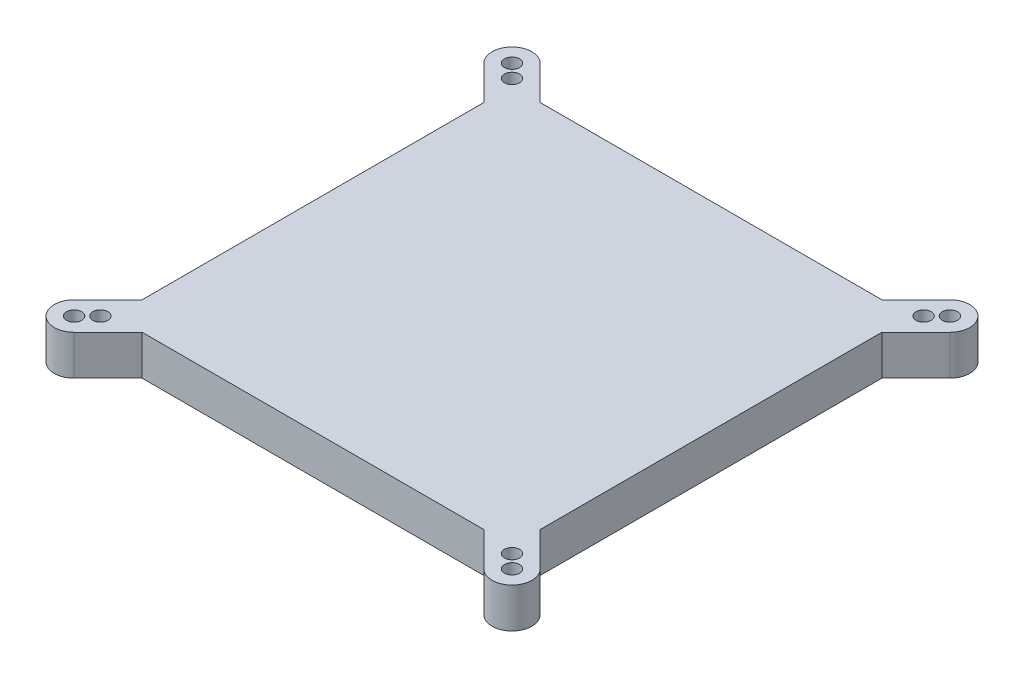
ISO-10303-21;
HEADER;
FILE_DESCRIPTION(('STEP AP214'),'2;1');
FILE_NAME('part.step','',(''),(''),'','','');
FILE_SCHEMA(('AUTOMOTIVE_DESIGN { 1 0 10303 214 1 1 1 1 }'));
ENDSEC;
DATA;
#1=APPLICATION_CONTEXT('core data for automotive mechanical design processes');
#2=APPLICATION_PROTOCOL_DEFINITION('international standard','automotive_design',2000,#1);
#3=PRODUCT_CONTEXT('',#1,'mechanical');
#4=PRODUCT('Part','Part','',(#3));
#5=PRODUCT_RELATED_PRODUCT_CATEGORY('part','',(#4));
#6=PRODUCT_DEFINITION_FORMATION('','',#4);
#7=PRODUCT_DEFINITION_CONTEXT('part definition',#1,'design');
#8=PRODUCT_DEFINITION('design','',#6,#7);
#9=PRODUCT_DEFINITION_SHAPE('','',#8);
#10=(LENGTH_UNIT() NAMED_UNIT(*) SI_UNIT(.MILLI.,.METRE.));
#11=(NAMED_UNIT(*) PLANE_ANGLE_UNIT() SI_UNIT($,.RADIAN.));
#12=(NAMED_UNIT(*) SI_UNIT($,.STERADIAN.) SOLID_ANGLE_UNIT());
#13=UNCERTAINTY_MEASURE_WITH_UNIT(LENGTH_MEASURE(1.E-05),#10,'distance_accuracy_value','');
#14=(GEOMETRIC_REPRESENTATION_CONTEXT(3) GLOBAL_UNCERTAINTY_ASSIGNED_CONTEXT((#13)) GLOBAL_UNIT_ASSIGNED_CONTEXT((#10,
#11,#12)) REPRESENTATION_CONTEXT('',''));
#15=CARTESIAN_POINT('',(0.,0.,0.));
#16=DIRECTION('',(0.,0.,1.));
#17=DIRECTION('',(1.,0.,0.));
#18=AXIS2_PLACEMENT_3D('',#15,#16,#17);
#19=CARTESIAN_POINT('',(200.,20.,0.));
#20=DIRECTION('',(-1.,0.,0.));
#21=DIRECTION('',(0.,0.,1.));
#22=AXIS2_PLACEMENT_3D('',#19,#20,#21);
#23=PLANE('',#22);
#24=DIRECTION('',(0.,-1.,0.));
#25=VECTOR('',#24,1.);
#26=CARTESIAN_POINT('',(200.,68.3076870304613,-185.857864376269));
#27=LINE('',#26,#25);
#28=CARTESIAN_POINT('',(200.,20.,-185.857864376269));
#29=VERTEX_POINT('',#28);
#30=CARTESIAN_POINT('',(200.,0.,-185.857864376269));
#31=VERTEX_POINT('',#30);
#32=EDGE_CURVE('E224',#29,#31,#27,.T.);
#33=ORIENTED_EDGE('',*,*,#32,.F.);
#34=DIRECTION('',(0.,0.,-1.));
#35=VECTOR('',#34,1.);
#36=CARTESIAN_POINT('',(200.,20.,0.));
#37=LINE('',#36,#35);
#38=CARTESIAN_POINT('',(200.,20.,-14.142135623731));
#39=VERTEX_POINT('',#38);
#40=EDGE_CURVE('E46',#39,#29,#37,.T.);
#41=ORIENTED_EDGE('',*,*,#40,.F.);
#42=DIRECTION('',(0.,-1.,0.));
#43=VECTOR('',#42,1.);
#44=CARTESIAN_POINT('',(200.,68.3076870304613,-14.142135623731));
#45=LINE('',#44,#43);
#46=CARTESIAN_POINT('',(200.,0.,-14.142135623731));
#47=VERTEX_POINT('',#46);
#48=EDGE_CURVE('E253',#39,#47,#45,.T.);
#49=ORIENTED_EDGE('',*,*,#48,.T.);
#50=DIRECTION('',(0.,0.,-1.));
#51=VECTOR('',#50,1.);
#52=CARTESIAN_POINT('',(200.,0.,0.));
#53=LINE('',#52,#51);
#54=EDGE_CURVE('E315',#47,#31,#53,.T.);
#55=ORIENTED_EDGE('',*,*,#54,.T.);
#56=EDGE_LOOP('',(#33,#41,#49,#55));
#57=FACE_BOUND('',#56,.T.);
#58=ADVANCED_FACE('F37',(#57),#23,.F.);
#59=CARTESIAN_POINT('',(0.,20.,-200.));
#60=DIRECTION('',(0.,0.,1.));
#61=DIRECTION('',(1.,0.,0.));
#62=AXIS2_PLACEMENT_3D('',#59,#60,#61);
#63=PLANE('',#62);
#64=DIRECTION('',(-1.,0.,0.));
#65=VECTOR('',#64,1.);
#66=CARTESIAN_POINT('',(0.,0.,-200.));
#67=LINE('',#66,#65);
#68=CARTESIAN_POINT('',(185.857864376269,0.,-200.));
#69=VERTEX_POINT('',#68);
#70=CARTESIAN_POINT('',(14.1421356237309,0.,-200.));
#71=VERTEX_POINT('',#70);
#72=EDGE_CURVE('E41',#69,#71,#67,.T.);
#73=ORIENTED_EDGE('',*,*,#72,.T.);
#74=DIRECTION('',(0.,-1.,0.));
#75=VECTOR('',#74,1.);
#76=CARTESIAN_POINT('',(14.142135623731,68.3076870304613,-200.));
#77=LINE('',#76,#75);
#78=CARTESIAN_POINT('',(14.1421356237309,20.,-200.));
#79=VERTEX_POINT('',#78);
#80=EDGE_CURVE('E62',#79,#71,#77,.T.);
#81=ORIENTED_EDGE('',*,*,#80,.F.);
#82=DIRECTION('',(-1.,0.,0.));
#83=VECTOR('',#82,1.);
#84=CARTESIAN_POINT('',(0.,20.,-200.));
#85=LINE('',#84,#83);
#86=CARTESIAN_POINT('',(185.857864376269,20.,-200.));
#87=VERTEX_POINT('',#86);
#88=EDGE_CURVE('E11',#87,#79,#85,.T.);
#89=ORIENTED_EDGE('',*,*,#88,.F.);
#90=DIRECTION('',(0.,-1.,0.));
#91=VECTOR('',#90,1.);
#92=CARTESIAN_POINT('',(185.857864376269,68.3076870304613,-200.));
#93=LINE('',#92,#91);
#94=EDGE_CURVE('E221',#87,#69,#93,.T.);
#95=ORIENTED_EDGE('',*,*,#94,.T.);
#96=EDGE_LOOP('',(#73,#81,#89,#95));
#97=FACE_BOUND('',#96,.T.);
#98=ADVANCED_FACE('F318',(#97),#63,.F.);
#99=CARTESIAN_POINT('',(0.,20.,0.));
#100=DIRECTION('',(1.,0.,0.));
#101=DIRECTION('',(0.,0.,-1.));
#102=AXIS2_PLACEMENT_3D('',#99,#100,#101);
#103=PLANE('',#102);
#104=DIRECTION('',(0.,0.,1.));
#105=VECTOR('',#104,1.);
#106=CARTESIAN_POINT('',(0.,20.,0.));
#107=LINE('',#106,#105);
#108=CARTESIAN_POINT('',(0.,20.,-185.857864376269));
#109=VERTEX_POINT('',#108);
#110=CARTESIAN_POINT('',(0.,20.,-14.142135623731));
#111=VERTEX_POINT('',#110);
#112=EDGE_CURVE('E54',#109,#111,#107,.T.);
#113=ORIENTED_EDGE('',*,*,#112,.F.);
#114=DIRECTION('',(0.,-1.,0.));
#115=VECTOR('',#114,1.);
#116=CARTESIAN_POINT('',(0.,68.3076870304613,-185.857864376269));
#117=LINE('',#116,#115);
#118=CARTESIAN_POINT('',(0.,0.,-185.857864376269));
#119=VERTEX_POINT('',#118);
#120=EDGE_CURVE('E168',#109,#119,#117,.T.);
#121=ORIENTED_EDGE('',*,*,#120,.T.);
#122=DIRECTION('',(0.,0.,1.));
#123=VECTOR('',#122,1.);
#124=CARTESIAN_POINT('',(0.,0.,0.));
#125=LINE('',#124,#123);
#126=CARTESIAN_POINT('',(0.,0.,-14.142135623731));
#127=VERTEX_POINT('',#126);
#128=EDGE_CURVE('E280',#119,#127,#125,.T.);
#129=ORIENTED_EDGE('',*,*,#128,.T.);
#130=DIRECTION('',(0.,-1.,0.));
#131=VECTOR('',#130,1.);
#132=CARTESIAN_POINT('',(0.,68.3076870304613,-14.142135623731));
#133=LINE('',#132,#131);
#134=EDGE_CURVE('E301',#111,#127,#133,.T.);
#135=ORIENTED_EDGE('',*,*,#134,.F.);
#136=EDGE_LOOP('',(#113,#121,#129,#135));
#137=FACE_BOUND('',#136,.T.);
#138=ADVANCED_FACE('F39',(#137),#103,.F.);
#139=CARTESIAN_POINT('',(0.,20.,0.));
#140=DIRECTION('',(0.,0.,-1.));
#141=DIRECTION('',(-1.,0.,0.));
#142=AXIS2_PLACEMENT_3D('',#139,#140,#141);
#143=PLANE('',#142);
#144=DIRECTION('',(1.,0.,0.));
#145=VECTOR('',#144,1.);
#146=CARTESIAN_POINT('',(0.,0.,0.));
#147=LINE('',#146,#145);
#148=CARTESIAN_POINT('',(14.142135623731,0.,0.));
#149=VERTEX_POINT('',#148);
#150=CARTESIAN_POINT('',(185.857864376269,0.,0.));
#151=VERTEX_POINT('',#150);
#152=EDGE_CURVE('E314',#149,#151,#147,.T.);
#153=ORIENTED_EDGE('',*,*,#152,.T.);
#154=DIRECTION('',(0.,-1.,0.));
#155=VECTOR('',#154,1.);
#156=CARTESIAN_POINT('',(185.857864376269,68.3076870304613,0.));
#157=LINE('',#156,#155);
#158=CARTESIAN_POINT('',(185.857864376269,20.,0.));
#159=VERTEX_POINT('',#158);
#160=EDGE_CURVE('E246',#159,#151,#157,.T.);
#161=ORIENTED_EDGE('',*,*,#160,.F.);
#162=DIRECTION('',(1.,0.,0.));
#163=VECTOR('',#162,1.);
#164=CARTESIAN_POINT('',(0.,20.,0.));
#165=LINE('',#164,#163);
#166=CARTESIAN_POINT('',(14.142135623731,20.,0.));
#167=VERTEX_POINT('',#166);
#168=EDGE_CURVE('E308',#167,#159,#165,.T.);
#169=ORIENTED_EDGE('',*,*,#168,.F.);
#170=DIRECTION('',(0.,-1.,0.));
#171=VECTOR('',#170,1.);
#172=CARTESIAN_POINT('',(14.142135623731,68.3076870304613,0.));
#173=LINE('',#172,#171);
#174=EDGE_CURVE('E298',#167,#149,#173,.T.);
#175=ORIENTED_EDGE('',*,*,#174,.T.);
#176=EDGE_LOOP('',(#153,#161,#169,#175));
#177=FACE_BOUND('',#176,.T.);
#178=ADVANCED_FACE('F361',(#177),#143,.F.);
#179=CARTESIAN_POINT('',(0.,20.,0.));
#180=DIRECTION('',(0.,-1.,0.));
#181=DIRECTION('',(0.,0.,-1.));
#182=AXIS2_PLACEMENT_3D('',#179,#180,#181);
#183=PLANE('',#182);
#184=DIRECTION('',(0.707106781186547,0.,0.707106781186548));
#185=VECTOR('',#184,1.);
#186=CARTESIAN_POINT('',(-7.07106781186548,20.,-192.928932188135));
#187=LINE('',#186,#185);
#188=CARTESIAN_POINT('',(-17.0876252708111,20.,-202.94548964708));
#189=VERTEX_POINT('',#188);
#190=EDGE_CURVE('E154',#189,#109,#187,.T.);
#191=ORIENTED_EDGE('',*,*,#190,.T.);
#192=ORIENTED_EDGE('',*,*,#112,.T.);
#193=DIRECTION('',(0.707106781186547,0.,-0.707106781186548));
#194=VECTOR('',#193,1.);
#195=CARTESIAN_POINT('',(-7.07106781186548,20.,-7.07106781186547));
#196=LINE('',#195,#194);
#197=CARTESIAN_POINT('',(-17.0876252708111,20.,2.94548964708019));
#198=VERTEX_POINT('',#197);
#199=EDGE_CURVE('E271',#198,#111,#196,.T.);
#200=ORIENTED_EDGE('',*,*,#199,.F.);
#201=CARTESIAN_POINT('',(-10.0165574589457,20.,10.0165574589457));
#202=DIRECTION('',(0.,-1.,0.));
#203=DIRECTION('',(0.,0.,-1.));
#204=AXIS2_PLACEMENT_3D('',#201,#202,#203);
#205=CIRCLE('',#204,10.);
#206=CARTESIAN_POINT('',(-2.9454896470802,20.,17.0876252708111));
#207=VERTEX_POINT('',#206);
#208=EDGE_CURVE('E270',#207,#198,#205,.T.);
#209=ORIENTED_EDGE('',*,*,#208,.F.);
#210=DIRECTION('',(-0.707106781186548,0.,0.707106781186547));
#211=VECTOR('',#210,1.);
#212=CARTESIAN_POINT('',(7.07106781186548,20.,7.07106781186548));
#213=LINE('',#212,#211);
#214=EDGE_CURVE('E267',#167,#207,#213,.T.);
#215=ORIENTED_EDGE('',*,*,#214,.F.);
#216=ORIENTED_EDGE('',*,*,#168,.T.);
#217=DIRECTION('',(0.707106781186548,0.,0.707106781186547));
#218=VECTOR('',#217,1.);
#219=CARTESIAN_POINT('',(192.928932188135,20.,7.07106781186548));
#220=LINE('',#219,#218);
#221=CARTESIAN_POINT('',(202.94548964708,20.,17.0876252708111));
#222=VERTEX_POINT('',#221);
#223=EDGE_CURVE('E247',#159,#222,#220,.T.);
#224=ORIENTED_EDGE('',*,*,#223,.T.);
#225=CARTESIAN_POINT('',(210.016557458946,20.,10.0165574589457));
#226=DIRECTION('',(0.,-1.,0.));
#227=DIRECTION('',(0.,0.,-1.));
#228=AXIS2_PLACEMENT_3D('',#225,#226,#227);
#229=CIRCLE('',#228,10.);
#230=CARTESIAN_POINT('',(217.087625270811,20.,2.94548964708019));
#231=VERTEX_POINT('',#230);
#232=EDGE_CURVE('E263',#222,#231,#229,.F.);
#233=ORIENTED_EDGE('',*,*,#232,.T.);
#234=DIRECTION('',(-0.707106781186547,0.,-0.707106781186548));
#235=VECTOR('',#234,1.);
#236=CARTESIAN_POINT('',(207.071067811865,20.,-7.07106781186547));
#237=LINE('',#236,#235);
#238=EDGE_CURVE('E250',#231,#39,#237,.T.);
#239=ORIENTED_EDGE('',*,*,#238,.T.);
#240=ORIENTED_EDGE('',*,*,#40,.T.);
#241=DIRECTION('',(-0.707106781186547,0.,0.707106781186548));
#242=VECTOR('',#241,1.);
#243=CARTESIAN_POINT('',(207.071067811865,20.,-192.928932188135));
#244=LINE('',#243,#242);
#245=CARTESIAN_POINT('',(217.087625270811,20.,-202.94548964708));
#246=VERTEX_POINT('',#245);
#247=EDGE_CURVE('E193',#246,#29,#244,.T.);
#248=ORIENTED_EDGE('',*,*,#247,.F.);
#249=CARTESIAN_POINT('',(210.016557458946,20.,-210.016557458946));
#250=DIRECTION('',(0.,-1.,0.));
#251=DIRECTION('',(0.,0.,-1.));
#252=AXIS2_PLACEMENT_3D('',#249,#250,#251);
#253=CIRCLE('',#252,10.);
#254=CARTESIAN_POINT('',(202.94548964708,20.,-217.087625270811));
#255=VERTEX_POINT('',#254);
#256=EDGE_CURVE('E192',#255,#246,#253,.T.);
#257=ORIENTED_EDGE('',*,*,#256,.F.);
#258=DIRECTION('',(0.707106781186548,0.,-0.707106781186547));
#259=VECTOR('',#258,1.);
#260=CARTESIAN_POINT('',(192.928932188135,20.,-207.071067811865));
#261=LINE('',#260,#259);
#262=EDGE_CURVE('E189',#87,#255,#261,.T.);
#263=ORIENTED_EDGE('',*,*,#262,.F.);
#264=ORIENTED_EDGE('',*,*,#88,.T.);
#265=DIRECTION('',(-0.707106781186548,0.,-0.707106781186547));
#266=VECTOR('',#265,1.);
#267=CARTESIAN_POINT('',(7.07106781186548,20.,-207.071067811865));
#268=LINE('',#267,#266);
#269=CARTESIAN_POINT('',(-2.9454896470802,20.,-217.087625270811));
#270=VERTEX_POINT('',#269);
#271=EDGE_CURVE('E157',#79,#270,#268,.T.);
#272=ORIENTED_EDGE('',*,*,#271,.T.);
#273=CARTESIAN_POINT('',(-10.0165574589457,20.,-210.016557458946));
#274=DIRECTION('',(0.,-1.,0.));
#275=DIRECTION('',(0.,0.,-1.));
#276=AXIS2_PLACEMENT_3D('',#273,#274,#275);
#277=CIRCLE('',#276,10.);
#278=EDGE_CURVE('E150',#270,#189,#277,.F.);
#279=ORIENTED_EDGE('',*,*,#278,.T.);
#280=EDGE_LOOP('',(#191,#192,#200,#209,#215,#216,#224,#233,#239,#240,#248,#257,#263,#264,#272,#279));
#281=FACE_BOUND('',#280,.T.);
#282=CARTESIAN_POINT('',(-3.41536736099135,20.,3.41536736099135));
#283=DIRECTION('',(0.,-1.,0.));
#284=DIRECTION('',(0.,0.,-1.));
#285=AXIS2_PLACEMENT_3D('',#282,#283,#284);
#286=CIRCLE('',#285,3.79708670005155);
#287=CARTESIAN_POINT('',(-3.41536736099135,20.,-0.381719339060196));
#288=VERTEX_POINT('',#287);
#289=EDGE_CURVE('E274',#288,#288,#286,.F.);
#290=ORIENTED_EDGE('',*,*,#289,.F.);
#291=EDGE_LOOP('',(#290));
#292=FACE_BOUND('',#291,.T.);
#293=CARTESIAN_POINT('',(-10.0165574589457,20.,10.0165574589457));
#294=DIRECTION('',(0.,-1.,0.));
#295=DIRECTION('',(0.,0.,-1.));
#296=AXIS2_PLACEMENT_3D('',#293,#294,#295);
#297=CIRCLE('',#296,3.79708670005155);
#298=CARTESIAN_POINT('',(-10.0165574589457,20.,6.21947075889412));
#299=VERTEX_POINT('',#298);
#300=EDGE_CURVE('E277',#299,#299,#297,.F.);
#301=ORIENTED_EDGE('',*,*,#300,.F.);
#302=EDGE_LOOP('',(#301));
#303=FACE_BOUND('',#302,.T.);
#304=CARTESIAN_POINT('',(210.016557458946,20.,10.0165574589457));
#305=DIRECTION('',(0.,-1.,0.));
#306=DIRECTION('',(0.,0.,-1.));
#307=AXIS2_PLACEMENT_3D('',#304,#305,#306);
#308=CIRCLE('',#307,3.79708670005155);
#309=CARTESIAN_POINT('',(210.016557458946,20.,6.21947075889412));
#310=VERTEX_POINT('',#309);
#311=EDGE_CURVE('E233',#310,#310,#308,.T.);
#312=ORIENTED_EDGE('',*,*,#311,.T.);
#313=EDGE_LOOP('',(#312));
#314=FACE_BOUND('',#313,.T.);
#315=CARTESIAN_POINT('',(203.415367360991,20.,3.41536736099135));
#316=DIRECTION('',(0.,-1.,0.));
#317=DIRECTION('',(0.,0.,-1.));
#318=AXIS2_PLACEMENT_3D('',#315,#316,#317);
#319=CIRCLE('',#318,3.79708670005155);
#320=CARTESIAN_POINT('',(203.415367360991,20.,-0.381719339060196));
#321=VERTEX_POINT('',#320);
#322=EDGE_CURVE('E260',#321,#321,#319,.T.);
#323=ORIENTED_EDGE('',*,*,#322,.T.);
#324=EDGE_LOOP('',(#323));
#325=FACE_BOUND('',#324,.T.);
#326=CARTESIAN_POINT('',(203.415367360991,20.,-203.415367360991));
#327=DIRECTION('',(0.,-1.,0.));
#328=DIRECTION('',(0.,0.,-1.));
#329=AXIS2_PLACEMENT_3D('',#326,#327,#328);
#330=CIRCLE('',#329,3.79708670005155);
#331=CARTESIAN_POINT('',(203.415367360991,20.,-207.212454061043));
#332=VERTEX_POINT('',#331);
#333=EDGE_CURVE('E196',#332,#332,#330,.F.);
#334=ORIENTED_EDGE('',*,*,#333,.F.);
#335=EDGE_LOOP('',(#334));
#336=FACE_BOUND('',#335,.T.);
#337=CARTESIAN_POINT('',(210.016557458946,20.,-210.016557458946));
#338=DIRECTION('',(0.,-1.,0.));
#339=DIRECTION('',(0.,0.,-1.));
#340=AXIS2_PLACEMENT_3D('',#337,#338,#339);
#341=CIRCLE('',#340,3.79708670005155);
#342=CARTESIAN_POINT('',(210.016557458946,20.,-213.813644158997));
#343=VERTEX_POINT('',#342);
#344=EDGE_CURVE('E199',#343,#343,#341,.F.);
#345=ORIENTED_EDGE('',*,*,#344,.F.);
#346=EDGE_LOOP('',(#345));
#347=FACE_BOUND('',#346,.T.);
#348=CARTESIAN_POINT('',(-10.0165574589457,20.,-210.016557458946));
#349=DIRECTION('',(0.,-1.,0.));
#350=DIRECTION('',(0.,0.,-1.));
#351=AXIS2_PLACEMENT_3D('',#348,#349,#350);
#352=CIRCLE('',#351,3.79708670005155);
#353=CARTESIAN_POINT('',(-10.0165574589457,20.,-213.813644158997));
#354=VERTEX_POINT('',#353);
#355=EDGE_CURVE('E183',#354,#354,#352,.T.);
#356=ORIENTED_EDGE('',*,*,#355,.T.);
#357=EDGE_LOOP('',(#356));
#358=FACE_BOUND('',#357,.T.);
#359=CARTESIAN_POINT('',(-3.41536736099135,20.,-203.415367360991));
#360=DIRECTION('',(0.,-1.,0.));
#361=DIRECTION('',(0.,0.,-1.));
#362=AXIS2_PLACEMENT_3D('',#359,#360,#361);
#363=CIRCLE('',#362,3.79708670005155);
#364=CARTESIAN_POINT('',(-3.41536736099135,20.,-207.212454061043));
#365=VERTEX_POINT('',#364);
#366=EDGE_CURVE('E161',#365,#365,#363,.T.);
#367=ORIENTED_EDGE('',*,*,#366,.T.);
#368=EDGE_LOOP('',(#367));
#369=FACE_BOUND('',#368,.T.);
#370=ADVANCED_FACE('F152',(#281,#292,#303,#314,#325,#336,#347,#358,#369),#183,.F.);
#371=CARTESIAN_POINT('',(0.,0.,0.));
#372=DIRECTION('',(0.,-1.,0.));
#373=DIRECTION('',(0.,0.,-1.));
#374=AXIS2_PLACEMENT_3D('',#371,#372,#373);
#375=PLANE('',#374);
#376=ORIENTED_EDGE('',*,*,#128,.F.);
#377=DIRECTION('',(-0.707106781186547,0.,-0.707106781186548));
#378=VECTOR('',#377,1.);
#379=CARTESIAN_POINT('',(-7.07106781186548,0.,-192.928932188135));
#380=LINE('',#379,#378);
#381=CARTESIAN_POINT('',(-17.0876252708111,0.,-202.94548964708));
#382=VERTEX_POINT('',#381);
#383=EDGE_CURVE('E186',#119,#382,#380,.T.);
#384=ORIENTED_EDGE('',*,*,#383,.T.);
#385=CARTESIAN_POINT('',(-10.0165574589457,0.,-210.016557458946));
#386=DIRECTION('',(0.,1.,0.));
#387=DIRECTION('',(0.,0.,1.));
#388=AXIS2_PLACEMENT_3D('',#385,#386,#387);
#389=CIRCLE('',#388,10.);
#390=CARTESIAN_POINT('',(-2.9454896470802,0.,-217.087625270811));
#391=VERTEX_POINT('',#390);
#392=EDGE_CURVE('E172',#382,#391,#389,.F.);
#393=ORIENTED_EDGE('',*,*,#392,.T.);
#394=DIRECTION('',(0.707106781186548,0.,0.707106781186547));
#395=VECTOR('',#394,1.);
#396=CARTESIAN_POINT('',(7.07106781186548,0.,-207.071067811865));
#397=LINE('',#396,#395);
#398=EDGE_CURVE('E326',#391,#71,#397,.T.);
#399=ORIENTED_EDGE('',*,*,#398,.T.);
#400=ORIENTED_EDGE('',*,*,#72,.F.);
#401=DIRECTION('',(-0.707106781186548,0.,0.707106781186547));
#402=VECTOR('',#401,1.);
#403=CARTESIAN_POINT('',(192.928932188135,0.,-207.071067811865));
#404=LINE('',#403,#402);
#405=CARTESIAN_POINT('',(202.94548964708,0.,-217.087625270811));
#406=VERTEX_POINT('',#405);
#407=EDGE_CURVE('E215',#406,#69,#404,.T.);
#408=ORIENTED_EDGE('',*,*,#407,.F.);
#409=CARTESIAN_POINT('',(210.016557458946,0.,-210.016557458946));
#410=DIRECTION('',(0.,-1.,0.));
#411=DIRECTION('',(0.,0.,1.));
#412=AXIS2_PLACEMENT_3D('',#409,#410,#411);
#413=CIRCLE('',#412,10.);
#414=CARTESIAN_POINT('',(217.087625270811,0.,-202.94548964708));
#415=VERTEX_POINT('',#414);
#416=EDGE_CURVE('E209',#415,#406,#413,.F.);
#417=ORIENTED_EDGE('',*,*,#416,.F.);
#418=DIRECTION('',(0.707106781186547,0.,-0.707106781186548));
#419=VECTOR('',#418,1.);
#420=CARTESIAN_POINT('',(207.071067811865,0.,-192.928932188135));
#421=LINE('',#420,#419);
#422=EDGE_CURVE('E212',#31,#415,#421,.T.);
#423=ORIENTED_EDGE('',*,*,#422,.F.);
#424=ORIENTED_EDGE('',*,*,#54,.F.);
#425=DIRECTION('',(0.707106781186547,0.,0.707106781186548));
#426=VECTOR('',#425,1.);
#427=CARTESIAN_POINT('',(207.071067811865,0.,-7.07106781186547));
#428=LINE('',#427,#426);
#429=CARTESIAN_POINT('',(217.087625270811,0.,2.94548964708019));
#430=VERTEX_POINT('',#429);
#431=EDGE_CURVE('E230',#47,#430,#428,.T.);
#432=ORIENTED_EDGE('',*,*,#431,.T.);
#433=CARTESIAN_POINT('',(210.016557458946,0.,10.0165574589457));
#434=DIRECTION('',(0.,1.,0.));
#435=DIRECTION('',(0.,0.,-1.));
#436=AXIS2_PLACEMENT_3D('',#433,#434,#435);
#437=CIRCLE('',#436,10.);
#438=CARTESIAN_POINT('',(202.94548964708,0.,17.0876252708111));
#439=VERTEX_POINT('',#438);
#440=EDGE_CURVE('E237',#430,#439,#437,.F.);
#441=ORIENTED_EDGE('',*,*,#440,.T.);
#442=DIRECTION('',(-0.707106781186548,0.,-0.707106781186547));
#443=VECTOR('',#442,1.);
#444=CARTESIAN_POINT('',(192.928932188135,0.,7.07106781186548));
#445=LINE('',#444,#443);
#446=EDGE_CURVE('E234',#439,#151,#445,.T.);
#447=ORIENTED_EDGE('',*,*,#446,.T.);
#448=ORIENTED_EDGE('',*,*,#152,.F.);
#449=DIRECTION('',(0.707106781186548,0.,-0.707106781186547));
#450=VECTOR('',#449,1.);
#451=CARTESIAN_POINT('',(7.07106781186548,0.,7.07106781186548));
#452=LINE('',#451,#450);
#453=CARTESIAN_POINT('',(-2.9454896470802,0.,17.0876252708111));
#454=VERTEX_POINT('',#453);
#455=EDGE_CURVE('E292',#454,#149,#452,.T.);
#456=ORIENTED_EDGE('',*,*,#455,.F.);
#457=CARTESIAN_POINT('',(-10.0165574589457,0.,10.0165574589457));
#458=DIRECTION('',(0.,-1.,0.));
#459=DIRECTION('',(0.,0.,-1.));
#460=AXIS2_PLACEMENT_3D('',#457,#458,#459);
#461=CIRCLE('',#460,10.);
#462=CARTESIAN_POINT('',(-17.0876252708111,0.,2.94548964708019));
#463=VERTEX_POINT('',#462);
#464=EDGE_CURVE('E286',#463,#454,#461,.F.);
#465=ORIENTED_EDGE('',*,*,#464,.F.);
#466=DIRECTION('',(-0.707106781186547,0.,0.707106781186548));
#467=VECTOR('',#466,1.);
#468=CARTESIAN_POINT('',(-7.07106781186548,0.,-7.07106781186547));
#469=LINE('',#468,#467);
#470=EDGE_CURVE('E289',#127,#463,#469,.T.);
#471=ORIENTED_EDGE('',*,*,#470,.F.);
#472=EDGE_LOOP('',(#376,#384,#393,#399,#400,#408,#417,#423,#424,#432,#441,#447,#448,#456,#465,#471));
#473=FACE_BOUND('',#472,.T.);
#474=CARTESIAN_POINT('',(-3.41536736099135,0.,3.41536736099135));
#475=DIRECTION('',(0.,-1.,0.));
#476=DIRECTION('',(0.,0.,-1.));
#477=AXIS2_PLACEMENT_3D('',#474,#475,#476);
#478=CIRCLE('',#477,3.79708670005155);
#479=CARTESIAN_POINT('',(-3.41536736099135,0.,-0.381719339060196));
#480=VERTEX_POINT('',#479);
#481=EDGE_CURVE('E249',#480,#480,#478,.T.);
#482=ORIENTED_EDGE('',*,*,#481,.F.);
#483=EDGE_LOOP('',(#482));
#484=FACE_BOUND('',#483,.T.);
#485=CARTESIAN_POINT('',(-10.0165574589457,0.,10.0165574589457));
#486=DIRECTION('',(0.,-1.,0.));
#487=DIRECTION('',(0.,0.,-1.));
#488=AXIS2_PLACEMENT_3D('',#485,#486,#487);
#489=CIRCLE('',#488,3.79708670005155);
#490=CARTESIAN_POINT('',(-10.0165574589457,0.,6.21947075889412));
#491=VERTEX_POINT('',#490);
#492=EDGE_CURVE('E283',#491,#491,#489,.T.);
#493=ORIENTED_EDGE('',*,*,#492,.F.);
#494=EDGE_LOOP('',(#493));
#495=FACE_BOUND('',#494,.T.);
#496=CARTESIAN_POINT('',(203.415367360991,0.,3.41536736099135));
#497=DIRECTION('',(0.,1.,0.));
#498=DIRECTION('',(0.,0.,-1.));
#499=AXIS2_PLACEMENT_3D('',#496,#497,#498);
#500=CIRCLE('',#499,3.79708670005155);
#501=CARTESIAN_POINT('',(203.415367360991,0.,-0.381719339060196));
#502=VERTEX_POINT('',#501);
#503=EDGE_CURVE('E243',#502,#502,#500,.T.);
#504=ORIENTED_EDGE('',*,*,#503,.T.);
#505=EDGE_LOOP('',(#504));
#506=FACE_BOUND('',#505,.T.);
#507=CARTESIAN_POINT('',(210.016557458946,0.,10.0165574589457));
#508=DIRECTION('',(0.,1.,0.));
#509=DIRECTION('',(0.,0.,-1.));
#510=AXIS2_PLACEMENT_3D('',#507,#508,#509);
#511=CIRCLE('',#510,3.79708670005155);
#512=CARTESIAN_POINT('',(210.016557458946,0.,6.21947075889412));
#513=VERTEX_POINT('',#512);
#514=EDGE_CURVE('E240',#513,#513,#511,.T.);
#515=ORIENTED_EDGE('',*,*,#514,.T.);
#516=EDGE_LOOP('',(#515));
#517=FACE_BOUND('',#516,.T.);
#518=CARTESIAN_POINT('',(203.415367360991,0.,-203.415367360991));
#519=DIRECTION('',(0.,-1.,0.));
#520=DIRECTION('',(0.,0.,1.));
#521=AXIS2_PLACEMENT_3D('',#518,#519,#520);
#522=CIRCLE('',#521,3.79708670005155);
#523=CARTESIAN_POINT('',(203.415367360991,0.,-199.61828066094));
#524=VERTEX_POINT('',#523);
#525=EDGE_CURVE('E203',#524,#524,#522,.T.);
#526=ORIENTED_EDGE('',*,*,#525,.F.);
#527=EDGE_LOOP('',(#526));
#528=FACE_BOUND('',#527,.T.);
#529=CARTESIAN_POINT('',(210.016557458946,0.,-210.016557458946));
#530=DIRECTION('',(0.,-1.,0.));
#531=DIRECTION('',(0.,0.,1.));
#532=AXIS2_PLACEMENT_3D('',#529,#530,#531);
#533=CIRCLE('',#532,3.79708670005155);
#534=CARTESIAN_POINT('',(210.016557458946,0.,-206.219470758894));
#535=VERTEX_POINT('',#534);
#536=EDGE_CURVE('E206',#535,#535,#533,.T.);
#537=ORIENTED_EDGE('',*,*,#536,.F.);
#538=EDGE_LOOP('',(#537));
#539=FACE_BOUND('',#538,.T.);
#540=CARTESIAN_POINT('',(-3.41536736099135,0.,-203.415367360991));
#541=DIRECTION('',(0.,1.,0.));
#542=DIRECTION('',(0.,0.,1.));
#543=AXIS2_PLACEMENT_3D('',#540,#541,#542);
#544=CIRCLE('',#543,3.79708670005155);
#545=CARTESIAN_POINT('',(-3.41536736099135,0.,-199.61828066094));
#546=VERTEX_POINT('',#545);
#547=EDGE_CURVE('E181',#546,#546,#544,.T.);
#548=ORIENTED_EDGE('',*,*,#547,.T.);
#549=EDGE_LOOP('',(#548));
#550=FACE_BOUND('',#549,.T.);
#551=CARTESIAN_POINT('',(-10.0165574589457,0.,-210.016557458946));
#552=DIRECTION('',(0.,1.,0.));
#553=DIRECTION('',(0.,0.,1.));
#554=AXIS2_PLACEMENT_3D('',#551,#552,#553);
#555=CIRCLE('',#554,3.79708670005155);
#556=CARTESIAN_POINT('',(-10.0165574589457,0.,-206.219470758894));
#557=VERTEX_POINT('',#556);
#558=EDGE_CURVE('E332',#557,#557,#555,.T.);
#559=ORIENTED_EDGE('',*,*,#558,.T.);
#560=EDGE_LOOP('',(#559));
#561=FACE_BOUND('',#560,.T.);
#562=ADVANCED_FACE('F328',(#473,#484,#495,#506,#517,#528,#539,#550,#561),#375,.T.);
#563=CARTESIAN_POINT('',(-10.0165574589457,68.3076870304613,10.0165574589457));
#564=DIRECTION('',(0.,-1.,0.));
#565=DIRECTION('',(0.,0.,-1.));
#566=AXIS2_PLACEMENT_3D('',#563,#564,#565);
#567=CYLINDRICAL_SURFACE('',#566,3.79708670005155);
#568=ORIENTED_EDGE('',*,*,#300,.T.);
#569=EDGE_LOOP('',(#568));
#570=FACE_BOUND('',#569,.T.);
#571=ORIENTED_EDGE('',*,*,#492,.T.);
#572=EDGE_LOOP('',(#571));
#573=FACE_BOUND('',#572,.T.);
#574=ADVANCED_FACE('F443',(#570,#573),#567,.F.);
#575=CARTESIAN_POINT('',(-3.41536736099135,68.3076870304613,3.41536736099135));
#576=DIRECTION('',(0.,-1.,0.));
#577=DIRECTION('',(0.,0.,-1.));
#578=AXIS2_PLACEMENT_3D('',#575,#576,#577);
#579=CYLINDRICAL_SURFACE('',#578,3.79708670005155);
#580=ORIENTED_EDGE('',*,*,#289,.T.);
#581=EDGE_LOOP('',(#580));
#582=FACE_BOUND('',#581,.T.);
#583=ORIENTED_EDGE('',*,*,#481,.T.);
#584=EDGE_LOOP('',(#583));
#585=FACE_BOUND('',#584,.T.);
#586=ADVANCED_FACE('F438',(#582,#585),#579,.F.);
#587=CARTESIAN_POINT('',(-7.07106781186548,68.3076870304613,-7.07106781186547));
#588=DIRECTION('',(0.707106781186548,0.,0.707106781186547));
#589=DIRECTION('',(0.707106781186547,0.,-0.707106781186548));
#590=AXIS2_PLACEMENT_3D('',#587,#588,#589);
#591=PLANE('',#590);
#592=DIRECTION('',(0.,-1.,0.));
#593=VECTOR('',#592,1.);
#594=CARTESIAN_POINT('',(-17.0876252708111,68.3076870304613,2.94548964708019));
#595=LINE('',#594,#593);
#596=EDGE_CURVE('E295',#198,#463,#595,.T.);
#597=ORIENTED_EDGE('',*,*,#596,.F.);
#598=ORIENTED_EDGE('',*,*,#199,.T.);
#599=ORIENTED_EDGE('',*,*,#134,.T.);
#600=ORIENTED_EDGE('',*,*,#470,.T.);
#601=EDGE_LOOP('',(#597,#598,#599,#600));
#602=FACE_BOUND('',#601,.T.);
#603=ADVANCED_FACE('F434',(#602),#591,.F.);
#604=CARTESIAN_POINT('',(7.07106781186548,68.3076870304613,7.07106781186548));
#605=DIRECTION('',(-0.707106781186547,0.,-0.707106781186548));
#606=DIRECTION('',(-0.707106781186548,0.,0.707106781186547));
#607=AXIS2_PLACEMENT_3D('',#604,#605,#606);
#608=PLANE('',#607);
#609=ORIENTED_EDGE('',*,*,#174,.F.);
#610=ORIENTED_EDGE('',*,*,#214,.T.);
#611=DIRECTION('',(0.,-1.,0.));
#612=VECTOR('',#611,1.);
#613=CARTESIAN_POINT('',(-2.9454896470802,68.3076870304613,17.0876252708111));
#614=LINE('',#613,#612);
#615=EDGE_CURVE('E296',#207,#454,#614,.T.);
#616=ORIENTED_EDGE('',*,*,#615,.T.);
#617=ORIENTED_EDGE('',*,*,#455,.T.);
#618=EDGE_LOOP('',(#609,#610,#616,#617));
#619=FACE_BOUND('',#618,.T.);
#620=ADVANCED_FACE('F431',(#619),#608,.F.);
#621=CARTESIAN_POINT('',(-10.0165574589457,68.3076870304613,10.0165574589457));
#622=DIRECTION('',(0.,-1.,0.));
#623=DIRECTION('',(0.,0.,-1.));
#624=AXIS2_PLACEMENT_3D('',#621,#622,#623);
#625=CYLINDRICAL_SURFACE('',#624,10.);
#626=ORIENTED_EDGE('',*,*,#615,.F.);
#627=ORIENTED_EDGE('',*,*,#208,.T.);
#628=ORIENTED_EDGE('',*,*,#596,.T.);
#629=ORIENTED_EDGE('',*,*,#464,.T.);
#630=EDGE_LOOP('',(#626,#627,#628,#629));
#631=FACE_BOUND('',#630,.T.);
#632=ADVANCED_FACE('F430',(#631),#625,.T.);
#633=CARTESIAN_POINT('',(210.016557458946,68.3076870304613,10.0165574589457));
#634=DIRECTION('',(0.,-1.,0.));
#635=DIRECTION('',(0.,0.,-1.));
#636=AXIS2_PLACEMENT_3D('',#633,#634,#635);
#637=CYLINDRICAL_SURFACE('',#636,10.);
#638=ORIENTED_EDGE('',*,*,#232,.F.);
#639=DIRECTION('',(0.,-1.,0.));
#640=VECTOR('',#639,1.);
#641=CARTESIAN_POINT('',(202.94548964708,68.3076870304613,17.0876252708111));
#642=LINE('',#641,#640);
#643=EDGE_CURVE('E202',#222,#439,#642,.T.);
#644=ORIENTED_EDGE('',*,*,#643,.T.);
#645=ORIENTED_EDGE('',*,*,#440,.F.);
#646=DIRECTION('',(0.,-1.,0.));
#647=VECTOR('',#646,1.);
#648=CARTESIAN_POINT('',(217.087625270811,68.3076870304613,2.94548964708019));
#649=LINE('',#648,#647);
#650=EDGE_CURVE('E251',#231,#430,#649,.T.);
#651=ORIENTED_EDGE('',*,*,#650,.F.);
#652=EDGE_LOOP('',(#638,#644,#645,#651));
#653=FACE_BOUND('',#652,.T.);
#654=ADVANCED_FACE('F381',(#653),#637,.T.);
#655=CARTESIAN_POINT('',(207.071067811865,68.3076870304613,-7.07106781186547));
#656=DIRECTION('',(0.707106781186548,0.,-0.707106781186547));
#657=DIRECTION('',(-0.707106781186547,0.,-0.707106781186548));
#658=AXIS2_PLACEMENT_3D('',#655,#656,#657);
#659=PLANE('',#658);
#660=ORIENTED_EDGE('',*,*,#238,.F.);
#661=ORIENTED_EDGE('',*,*,#650,.T.);
#662=ORIENTED_EDGE('',*,*,#431,.F.);
#663=ORIENTED_EDGE('',*,*,#48,.F.);
#664=EDGE_LOOP('',(#660,#661,#662,#663));
#665=FACE_BOUND('',#664,.T.);
#666=ADVANCED_FACE('F385',(#665),#659,.T.);
#667=CARTESIAN_POINT('',(210.016557458946,68.3076870304613,10.0165574589457));
#668=DIRECTION('',(0.,-1.,0.));
#669=DIRECTION('',(0.,0.,-1.));
#670=AXIS2_PLACEMENT_3D('',#667,#668,#669);
#671=CYLINDRICAL_SURFACE('',#670,3.79708670005155);
#672=ORIENTED_EDGE('',*,*,#311,.F.);
#673=EDGE_LOOP('',(#672));
#674=FACE_BOUND('',#673,.T.);
#675=ORIENTED_EDGE('',*,*,#514,.F.);
#676=EDGE_LOOP('',(#675));
#677=FACE_BOUND('',#676,.T.);
#678=ADVANCED_FACE('F416',(#674,#677),#671,.F.);
#679=CARTESIAN_POINT('',(203.415367360991,68.3076870304613,3.41536736099135));
#680=DIRECTION('',(0.,-1.,0.));
#681=DIRECTION('',(0.,0.,-1.));
#682=AXIS2_PLACEMENT_3D('',#679,#680,#681);
#683=CYLINDRICAL_SURFACE('',#682,3.79708670005155);
#684=ORIENTED_EDGE('',*,*,#322,.F.);
#685=EDGE_LOOP('',(#684));
#686=FACE_BOUND('',#685,.T.);
#687=ORIENTED_EDGE('',*,*,#503,.F.);
#688=EDGE_LOOP('',(#687));
#689=FACE_BOUND('',#688,.T.);
#690=ADVANCED_FACE('F419',(#686,#689),#683,.F.);
#691=CARTESIAN_POINT('',(192.928932188135,68.3076870304613,7.07106781186548));
#692=DIRECTION('',(-0.707106781186547,0.,0.707106781186548));
#693=DIRECTION('',(0.707106781186548,0.,0.707106781186547));
#694=AXIS2_PLACEMENT_3D('',#691,#692,#693);
#695=PLANE('',#694);
#696=ORIENTED_EDGE('',*,*,#223,.F.);
#697=ORIENTED_EDGE('',*,*,#160,.T.);
#698=ORIENTED_EDGE('',*,*,#446,.F.);
#699=ORIENTED_EDGE('',*,*,#643,.F.);
#700=EDGE_LOOP('',(#696,#697,#698,#699));
#701=FACE_BOUND('',#700,.T.);
#702=ADVANCED_FACE('F374',(#701),#695,.T.);
#703=CARTESIAN_POINT('',(210.016557458946,68.3076870304613,-210.016557458946));
#704=DIRECTION('',(0.,-1.,0.));
#705=DIRECTION('',(0.,0.,-1.));
#706=AXIS2_PLACEMENT_3D('',#703,#704,#705);
#707=CYLINDRICAL_SURFACE('',#706,3.79708670005155);
#708=ORIENTED_EDGE('',*,*,#344,.T.);
#709=EDGE_LOOP('',(#708));
#710=FACE_BOUND('',#709,.T.);
#711=ORIENTED_EDGE('',*,*,#536,.T.);
#712=EDGE_LOOP('',(#711));
#713=FACE_BOUND('',#712,.T.);
#714=ADVANCED_FACE('F409',(#710,#713),#707,.F.);
#715=CARTESIAN_POINT('',(203.415367360991,68.3076870304613,-203.415367360991));
#716=DIRECTION('',(0.,-1.,0.));
#717=DIRECTION('',(0.,0.,-1.));
#718=AXIS2_PLACEMENT_3D('',#715,#716,#717);
#719=CYLINDRICAL_SURFACE('',#718,3.79708670005155);
#720=ORIENTED_EDGE('',*,*,#333,.T.);
#721=EDGE_LOOP('',(#720));
#722=FACE_BOUND('',#721,.T.);
#723=ORIENTED_EDGE('',*,*,#525,.T.);
#724=EDGE_LOOP('',(#723));
#725=FACE_BOUND('',#724,.T.);
#726=ADVANCED_FACE('F404',(#722,#725),#719,.F.);
#727=CARTESIAN_POINT('',(207.071067811865,68.3076870304613,-192.928932188135));
#728=DIRECTION('',(-0.707106781186548,0.,-0.707106781186547));
#729=DIRECTION('',(-0.707106781186547,0.,0.707106781186548));
#730=AXIS2_PLACEMENT_3D('',#727,#728,#729);
#731=PLANE('',#730);
#732=DIRECTION('',(0.,-1.,0.));
#733=VECTOR('',#732,1.);
#734=CARTESIAN_POINT('',(217.087625270811,68.3076870304613,-202.94548964708));
#735=LINE('',#734,#733);
#736=EDGE_CURVE('E218',#246,#415,#735,.T.);
#737=ORIENTED_EDGE('',*,*,#736,.F.);
#738=ORIENTED_EDGE('',*,*,#247,.T.);
#739=ORIENTED_EDGE('',*,*,#32,.T.);
#740=ORIENTED_EDGE('',*,*,#422,.T.);
#741=EDGE_LOOP('',(#737,#738,#739,#740));
#742=FACE_BOUND('',#741,.T.);
#743=ADVANCED_FACE('F390',(#742),#731,.F.);
#744=CARTESIAN_POINT('',(192.928932188135,68.3076870304613,-207.071067811865));
#745=DIRECTION('',(0.707106781186547,0.,0.707106781186548));
#746=DIRECTION('',(0.707106781186548,0.,-0.707106781186547));
#747=AXIS2_PLACEMENT_3D('',#744,#745,#746);
#748=PLANE('',#747);
#749=ORIENTED_EDGE('',*,*,#94,.F.);
#750=ORIENTED_EDGE('',*,*,#262,.T.);
#751=DIRECTION('',(0.,-1.,0.));
#752=VECTOR('',#751,1.);
#753=CARTESIAN_POINT('',(202.94548964708,68.3076870304613,-217.087625270811));
#754=LINE('',#753,#752);
#755=EDGE_CURVE('E219',#255,#406,#754,.T.);
#756=ORIENTED_EDGE('',*,*,#755,.T.);
#757=ORIENTED_EDGE('',*,*,#407,.T.);
#758=EDGE_LOOP('',(#749,#750,#756,#757));
#759=FACE_BOUND('',#758,.T.);
#760=ADVANCED_FACE('F396',(#759),#748,.F.);
#761=CARTESIAN_POINT('',(210.016557458946,68.3076870304613,-210.016557458946));
#762=DIRECTION('',(0.,-1.,0.));
#763=DIRECTION('',(0.,0.,-1.));
#764=AXIS2_PLACEMENT_3D('',#761,#762,#763);
#765=CYLINDRICAL_SURFACE('',#764,10.);
#766=ORIENTED_EDGE('',*,*,#755,.F.);
#767=ORIENTED_EDGE('',*,*,#256,.T.);
#768=ORIENTED_EDGE('',*,*,#736,.T.);
#769=ORIENTED_EDGE('',*,*,#416,.T.);
#770=EDGE_LOOP('',(#766,#767,#768,#769));
#771=FACE_BOUND('',#770,.T.);
#772=ADVANCED_FACE('F394',(#771),#765,.T.);
#773=CARTESIAN_POINT('',(-10.0165574589457,68.3076870304613,-210.016557458946));
#774=DIRECTION('',(0.,-1.,0.));
#775=DIRECTION('',(0.,0.,-1.));
#776=AXIS2_PLACEMENT_3D('',#773,#774,#775);
#777=CYLINDRICAL_SURFACE('',#776,10.);
#778=ORIENTED_EDGE('',*,*,#278,.F.);
#779=DIRECTION('',(0.,-1.,0.));
#780=VECTOR('',#779,1.);
#781=CARTESIAN_POINT('',(-2.9454896470802,68.3076870304613,-217.087625270811));
#782=LINE('',#781,#780);
#783=EDGE_CURVE('E174',#270,#391,#782,.T.);
#784=ORIENTED_EDGE('',*,*,#783,.T.);
#785=ORIENTED_EDGE('',*,*,#392,.F.);
#786=DIRECTION('',(0.,-1.,0.));
#787=VECTOR('',#786,1.);
#788=CARTESIAN_POINT('',(-17.0876252708111,68.3076870304613,-202.94548964708));
#789=LINE('',#788,#787);
#790=EDGE_CURVE('E166',#189,#382,#789,.T.);
#791=ORIENTED_EDGE('',*,*,#790,.F.);
#792=EDGE_LOOP('',(#778,#784,#785,#791));
#793=FACE_BOUND('',#792,.T.);
#794=ADVANCED_FACE('F170',(#793),#777,.T.);
#795=CARTESIAN_POINT('',(-7.07106781186548,68.3076870304613,-192.928932188135));
#796=DIRECTION('',(-0.707106781186548,0.,0.707106781186547));
#797=DIRECTION('',(0.707106781186547,0.,0.707106781186548));
#798=AXIS2_PLACEMENT_3D('',#795,#796,#797);
#799=PLANE('',#798);
#800=ORIENTED_EDGE('',*,*,#190,.F.);
#801=ORIENTED_EDGE('',*,*,#790,.T.);
#802=ORIENTED_EDGE('',*,*,#383,.F.);
#803=ORIENTED_EDGE('',*,*,#120,.F.);
#804=EDGE_LOOP('',(#800,#801,#802,#803));
#805=FACE_BOUND('',#804,.T.);
#806=ADVANCED_FACE('F164',(#805),#799,.T.);
#807=CARTESIAN_POINT('',(-10.0165574589457,68.3076870304613,-210.016557458946));
#808=DIRECTION('',(0.,-1.,0.));
#809=DIRECTION('',(0.,0.,-1.));
#810=AXIS2_PLACEMENT_3D('',#807,#808,#809);
#811=CYLINDRICAL_SURFACE('',#810,3.79708670005155);
#812=ORIENTED_EDGE('',*,*,#355,.F.);
#813=EDGE_LOOP('',(#812));
#814=FACE_BOUND('',#813,.T.);
#815=ORIENTED_EDGE('',*,*,#558,.F.);
#816=EDGE_LOOP('',(#815));
#817=FACE_BOUND('',#816,.T.);
#818=ADVANCED_FACE('F343',(#814,#817),#811,.F.);
#819=CARTESIAN_POINT('',(-3.41536736099135,68.3076870304613,-203.415367360991));
#820=DIRECTION('',(0.,-1.,0.));
#821=DIRECTION('',(0.,0.,-1.));
#822=AXIS2_PLACEMENT_3D('',#819,#820,#821);
#823=CYLINDRICAL_SURFACE('',#822,3.79708670005155);
#824=ORIENTED_EDGE('',*,*,#366,.F.);
#825=EDGE_LOOP('',(#824));
#826=FACE_BOUND('',#825,.T.);
#827=ORIENTED_EDGE('',*,*,#547,.F.);
#828=EDGE_LOOP('',(#827));
#829=FACE_BOUND('',#828,.T.);
#830=ADVANCED_FACE('F341',(#826,#829),#823,.F.);
#831=CARTESIAN_POINT('',(7.07106781186548,68.3076870304613,-207.071067811865));
#832=DIRECTION('',(0.707106781186547,0.,-0.707106781186548));
#833=DIRECTION('',(-0.707106781186548,0.,-0.707106781186547));
#834=AXIS2_PLACEMENT_3D('',#831,#832,#833);
#835=PLANE('',#834);
#836=ORIENTED_EDGE('',*,*,#271,.F.);
#837=ORIENTED_EDGE('',*,*,#80,.T.);
#838=ORIENTED_EDGE('',*,*,#398,.F.);
#839=ORIENTED_EDGE('',*,*,#783,.F.);
#840=EDGE_LOOP('',(#836,#837,#838,#839));
#841=FACE_BOUND('',#840,.T.);
#842=ADVANCED_FACE('F325',(#841),#835,.T.);
#843=CLOSED_SHELL('',(#58,#98,#138,#178,#370,#562,#574,#586,#603,#620,#632,#654,#666,#678,#690,
#702,#714,#726,#743,#760,#772,#794,#806,#818,#830,#842));
#844=MANIFOLD_SOLID_BREP('B2',#843);
#845=ADVANCED_BREP_SHAPE_REPRESENTATION('',(#18,#844),#14);
#846=SHAPE_DEFINITION_REPRESENTATION(#9,#845);
ENDSEC;
END-ISO-10303-21;
